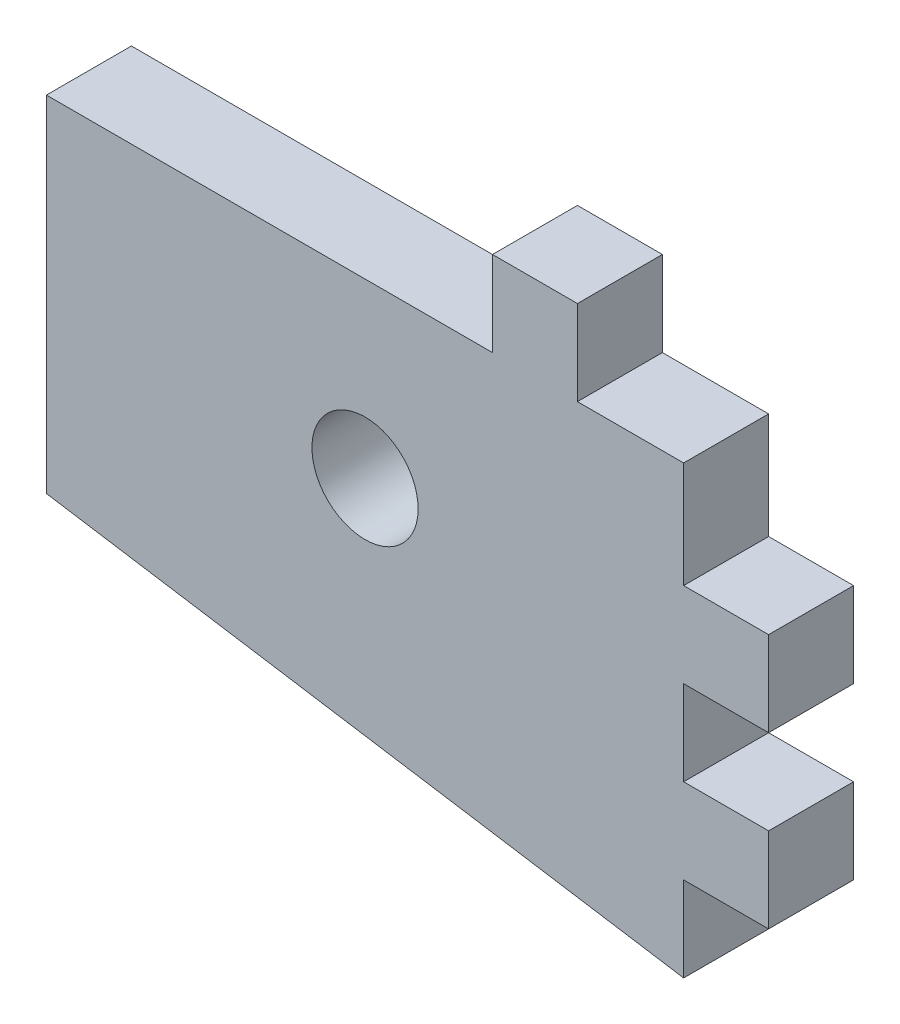
ISO-10303-21;
HEADER;
FILE_DESCRIPTION(('STEP AP214'),'2;1');
FILE_NAME('part.step','',(''),(''),'','','');
FILE_SCHEMA(('AUTOMOTIVE_DESIGN { 1 0 10303 214 1 1 1 1 }'));
ENDSEC;
DATA;
#1=APPLICATION_CONTEXT('core data for automotive mechanical design processes');
#2=APPLICATION_PROTOCOL_DEFINITION('international standard','automotive_design',2000,#1);
#3=PRODUCT_CONTEXT('',#1,'mechanical');
#4=PRODUCT('Part','Part','',(#3));
#5=PRODUCT_RELATED_PRODUCT_CATEGORY('part','',(#4));
#6=PRODUCT_DEFINITION_FORMATION('','',#4);
#7=PRODUCT_DEFINITION_CONTEXT('part definition',#1,'design');
#8=PRODUCT_DEFINITION('design','',#6,#7);
#9=PRODUCT_DEFINITION_SHAPE('','',#8);
#10=(LENGTH_UNIT() NAMED_UNIT(*) SI_UNIT(.MILLI.,.METRE.));
#11=(NAMED_UNIT(*) PLANE_ANGLE_UNIT() SI_UNIT($,.RADIAN.));
#12=(NAMED_UNIT(*) SI_UNIT($,.STERADIAN.) SOLID_ANGLE_UNIT());
#13=UNCERTAINTY_MEASURE_WITH_UNIT(LENGTH_MEASURE(1.E-05),#10,'distance_accuracy_value','');
#14=(GEOMETRIC_REPRESENTATION_CONTEXT(3) GLOBAL_UNCERTAINTY_ASSIGNED_CONTEXT((#13)) GLOBAL_UNIT_ASSIGNED_CONTEXT((#10,
#11,#12)) REPRESENTATION_CONTEXT('',''));
#15=CARTESIAN_POINT('',(0.,0.,0.));
#16=DIRECTION('',(0.,0.,1.));
#17=DIRECTION('',(1.,0.,0.));
#18=AXIS2_PLACEMENT_3D('',#15,#16,#17);
#19=CARTESIAN_POINT('',(0.,9.53947368421077,4.));
#20=DIRECTION('',(-1.,0.,0.));
#21=DIRECTION('',(0.,-1.,0.));
#22=AXIS2_PLACEMENT_3D('',#19,#20,#21);
#23=PLANE('',#22);
#24=DIRECTION('',(0.,1.,0.));
#25=VECTOR('',#24,1.);
#26=CARTESIAN_POINT('',(0.,9.53947368421077,4.));
#27=LINE('',#26,#25);
#28=CARTESIAN_POINT('',(0.,-3.46052631578922,4.));
#29=VERTEX_POINT('',#28);
#30=CARTESIAN_POINT('',(0.,0.539473684210779,4.));
#31=VERTEX_POINT('',#30);
#32=EDGE_CURVE('E39',#29,#31,#27,.T.);
#33=ORIENTED_EDGE('',*,*,#32,.F.);
#34=DIRECTION('',(0.,0.,1.));
#35=VECTOR('',#34,1.);
#36=CARTESIAN_POINT('',(0.,-3.46052631578923,0.));
#37=LINE('',#36,#35);
#38=CARTESIAN_POINT('',(0.,-3.46052631578923,0.));
#39=VERTEX_POINT('',#38);
#40=EDGE_CURVE('E295',#39,#29,#37,.T.);
#41=ORIENTED_EDGE('',*,*,#40,.F.);
#42=DIRECTION('',(0.,1.,0.));
#43=VECTOR('',#42,1.);
#44=CARTESIAN_POINT('',(0.,9.53947368421077,0.));
#45=LINE('',#44,#43);
#46=CARTESIAN_POINT('',(0.,0.539473684210772,0.));
#47=VERTEX_POINT('',#46);
#48=EDGE_CURVE('E182',#39,#47,#45,.T.);
#49=ORIENTED_EDGE('',*,*,#48,.T.);
#50=DIRECTION('',(0.,0.,1.));
#51=VECTOR('',#50,1.);
#52=CARTESIAN_POINT('',(0.,0.539473684210772,0.));
#53=LINE('',#52,#51);
#54=EDGE_CURVE('E250',#47,#31,#53,.T.);
#55=ORIENTED_EDGE('',*,*,#54,.T.);
#56=EDGE_LOOP('',(#33,#41,#49,#55));
#57=FACE_BOUND('',#56,.T.);
#58=ADVANCED_FACE('F35',(#57),#23,.F.);
#59=CARTESIAN_POINT('',(-30.,9.53947368421077,4.));
#60=DIRECTION('',(0.,-1.,0.));
#61=DIRECTION('',(1.,0.,0.));
#62=AXIS2_PLACEMENT_3D('',#59,#60,#61);
#63=PLANE('',#62);
#64=DIRECTION('',(0.,0.,1.));
#65=VECTOR('',#64,1.);
#66=CARTESIAN_POINT('',(-9.,9.53947368421077,0.));
#67=LINE('',#66,#65);
#68=CARTESIAN_POINT('',(-9.,9.53947368421077,0.));
#69=VERTEX_POINT('',#68);
#70=CARTESIAN_POINT('',(-9.,9.53947368421077,4.));
#71=VERTEX_POINT('',#70);
#72=EDGE_CURVE('E214',#69,#71,#67,.T.);
#73=ORIENTED_EDGE('',*,*,#72,.F.);
#74=DIRECTION('',(-1.,0.,0.));
#75=VECTOR('',#74,1.);
#76=CARTESIAN_POINT('',(-30.,9.53947368421077,0.));
#77=LINE('',#76,#75);
#78=CARTESIAN_POINT('',(-30.,9.53947368421077,0.));
#79=VERTEX_POINT('',#78);
#80=EDGE_CURVE('E262',#69,#79,#77,.T.);
#81=ORIENTED_EDGE('',*,*,#80,.T.);
#82=DIRECTION('',(0.,0.,-1.));
#83=VECTOR('',#82,1.);
#84=CARTESIAN_POINT('',(-30.,9.53947368421077,4.));
#85=LINE('',#84,#83);
#86=CARTESIAN_POINT('',(-30.,9.53947368421077,4.));
#87=VERTEX_POINT('',#86);
#88=EDGE_CURVE('E11',#87,#79,#85,.T.);
#89=ORIENTED_EDGE('',*,*,#88,.F.);
#90=DIRECTION('',(-1.,0.,0.));
#91=VECTOR('',#90,1.);
#92=CARTESIAN_POINT('',(-30.,9.53947368421077,4.));
#93=LINE('',#92,#91);
#94=EDGE_CURVE('E181',#71,#87,#93,.T.);
#95=ORIENTED_EDGE('',*,*,#94,.F.);
#96=EDGE_LOOP('',(#73,#81,#89,#95));
#97=FACE_BOUND('',#96,.T.);
#98=ADVANCED_FACE('F339',(#97),#63,.F.);
#99=DIRECTION('',(0.,0.,1.));
#100=VECTOR('',#99,1.);
#101=CARTESIAN_POINT('',(0.,4.53947368421077,0.));
#102=LINE('',#101,#100);
#103=CARTESIAN_POINT('',(0.,4.53947368421077,0.));
#104=VERTEX_POINT('',#103);
#105=CARTESIAN_POINT('',(0.,4.53947368421077,4.));
#106=VERTEX_POINT('',#105);
#107=EDGE_CURVE('E243',#104,#106,#102,.T.);
#108=ORIENTED_EDGE('',*,*,#107,.F.);
#109=CARTESIAN_POINT('',(0.,9.53947368421077,0.));
#110=VERTEX_POINT('',#109);
#111=EDGE_CURVE('E186',#104,#110,#45,.T.);
#112=ORIENTED_EDGE('',*,*,#111,.T.);
#113=DIRECTION('',(0.,0.,-1.));
#114=VECTOR('',#113,1.);
#115=CARTESIAN_POINT('',(0.,9.53947368421077,4.));
#116=LINE('',#115,#114);
#117=CARTESIAN_POINT('',(0.,9.53947368421077,4.));
#118=VERTEX_POINT('',#117);
#119=EDGE_CURVE('E196',#118,#110,#116,.T.);
#120=ORIENTED_EDGE('',*,*,#119,.F.);
#121=EDGE_CURVE('E304',#106,#118,#27,.T.);
#122=ORIENTED_EDGE('',*,*,#121,.F.);
#123=EDGE_LOOP('',(#108,#112,#120,#122));
#124=FACE_BOUND('',#123,.T.);
#125=ADVANCED_FACE('F278',(#124),#23,.F.);
#126=CARTESIAN_POINT('',(0.,0.,4.));
#127=DIRECTION('',(0.,0.,-1.));
#128=DIRECTION('',(-1.,0.,0.));
#129=AXIS2_PLACEMENT_3D('',#126,#127,#128);
#130=PLANE('',#129);
#131=CARTESIAN_POINT('',(-5.,9.53947368421077,4.));
#132=VERTEX_POINT('',#131);
#133=EDGE_CURVE('E184',#118,#132,#93,.T.);
#134=ORIENTED_EDGE('',*,*,#133,.T.);
#135=DIRECTION('',(0.,1.,0.));
#136=VECTOR('',#135,1.);
#137=CARTESIAN_POINT('',(-5.,9.53947368421077,4.));
#138=LINE('',#137,#136);
#139=CARTESIAN_POINT('',(-5.,13.5394736842108,4.));
#140=VERTEX_POINT('',#139);
#141=EDGE_CURVE('E61',#132,#140,#138,.T.);
#142=ORIENTED_EDGE('',*,*,#141,.T.);
#143=DIRECTION('',(-1.,0.,0.));
#144=VECTOR('',#143,1.);
#145=CARTESIAN_POINT('',(-5.,13.5394736842108,4.));
#146=LINE('',#145,#144);
#147=CARTESIAN_POINT('',(-9.,13.5394736842108,4.));
#148=VERTEX_POINT('',#147);
#149=EDGE_CURVE('E207',#140,#148,#146,.T.);
#150=ORIENTED_EDGE('',*,*,#149,.T.);
#151=DIRECTION('',(0.,-1.,0.));
#152=VECTOR('',#151,1.);
#153=CARTESIAN_POINT('',(-9.,9.53947368421077,4.));
#154=LINE('',#153,#152);
#155=EDGE_CURVE('E203',#148,#71,#154,.T.);
#156=ORIENTED_EDGE('',*,*,#155,.T.);
#157=ORIENTED_EDGE('',*,*,#94,.T.);
#158=DIRECTION('',(0.,-1.,0.));
#159=VECTOR('',#158,1.);
#160=CARTESIAN_POINT('',(-30.,9.53947368421077,4.));
#161=LINE('',#160,#159);
#162=CARTESIAN_POINT('',(-30.,-6.70899310605323,4.));
#163=VERTEX_POINT('',#162);
#164=EDGE_CURVE('E301',#87,#163,#161,.T.);
#165=ORIENTED_EDGE('',*,*,#164,.T.);
#166=DIRECTION('',(0.987688340595138,-0.156434465040228,0.));
#167=VECTOR('',#166,1.);
#168=CARTESIAN_POINT('',(-30.,-6.70899310605323,4.));
#169=LINE('',#168,#167);
#170=CARTESIAN_POINT('',(0.,-11.4605263157892,4.));
#171=VERTEX_POINT('',#170);
#172=EDGE_CURVE('E303',#163,#171,#169,.T.);
#173=ORIENTED_EDGE('',*,*,#172,.T.);
#174=CARTESIAN_POINT('',(0.,-7.46052631578923,4.));
#175=VERTEX_POINT('',#174);
#176=EDGE_CURVE('E284',#171,#175,#27,.T.);
#177=ORIENTED_EDGE('',*,*,#176,.T.);
#178=DIRECTION('',(1.,0.,0.));
#179=VECTOR('',#178,1.);
#180=CARTESIAN_POINT('',(0.,-7.46052631578923,4.));
#181=LINE('',#180,#179);
#182=CARTESIAN_POINT('',(4.,-7.46052631578923,4.));
#183=VERTEX_POINT('',#182);
#184=EDGE_CURVE('E157',#175,#183,#181,.T.);
#185=ORIENTED_EDGE('',*,*,#184,.T.);
#186=DIRECTION('',(0.,1.,0.));
#187=VECTOR('',#186,1.);
#188=CARTESIAN_POINT('',(4.,-3.46052631578923,4.));
#189=LINE('',#188,#187);
#190=CARTESIAN_POINT('',(4.,-3.46052631578923,4.));
#191=VERTEX_POINT('',#190);
#192=EDGE_CURVE('E368',#183,#191,#189,.T.);
#193=ORIENTED_EDGE('',*,*,#192,.T.);
#194=DIRECTION('',(-1.,0.,0.));
#195=VECTOR('',#194,1.);
#196=CARTESIAN_POINT('',(0.,-3.46052631578923,4.));
#197=LINE('',#196,#195);
#198=EDGE_CURVE('E53',#191,#29,#197,.T.);
#199=ORIENTED_EDGE('',*,*,#198,.T.);
#200=ORIENTED_EDGE('',*,*,#32,.T.);
#201=DIRECTION('',(1.,0.,0.));
#202=VECTOR('',#201,1.);
#203=CARTESIAN_POINT('',(0.,0.539473684210772,4.));
#204=LINE('',#203,#202);
#205=CARTESIAN_POINT('',(4.,0.539473684210771,4.));
#206=VERTEX_POINT('',#205);
#207=EDGE_CURVE('E237',#31,#206,#204,.T.);
#208=ORIENTED_EDGE('',*,*,#207,.T.);
#209=DIRECTION('',(0.,1.,0.));
#210=VECTOR('',#209,1.);
#211=CARTESIAN_POINT('',(4.,0.539473684210771,4.));
#212=LINE('',#211,#210);
#213=CARTESIAN_POINT('',(4.,4.53947368421077,4.));
#214=VERTEX_POINT('',#213);
#215=EDGE_CURVE('E233',#206,#214,#212,.T.);
#216=ORIENTED_EDGE('',*,*,#215,.T.);
#217=DIRECTION('',(-1.,0.,0.));
#218=VECTOR('',#217,1.);
#219=CARTESIAN_POINT('',(0.,4.53947368421077,4.));
#220=LINE('',#219,#218);
#221=EDGE_CURVE('E236',#214,#106,#220,.T.);
#222=ORIENTED_EDGE('',*,*,#221,.T.);
#223=ORIENTED_EDGE('',*,*,#121,.T.);
#224=EDGE_LOOP('',(#134,#142,#150,#156,#157,#165,#173,#177,#185,#193,#199,#200,#208,#216,#222,#223));
#225=FACE_BOUND('',#224,.T.);
#226=CARTESIAN_POINT('',(-15.,1.41524028907877,4.));
#227=DIRECTION('',(0.,0.,1.));
#228=DIRECTION('',(1.,0.,0.));
#229=AXIS2_PLACEMENT_3D('',#226,#227,#228);
#230=CIRCLE('',#229,2.5);
#231=CARTESIAN_POINT('',(-12.5,1.41524028907877,4.));
#232=VERTEX_POINT('',#231);
#233=EDGE_CURVE('E316',#232,#232,#230,.T.);
#234=ORIENTED_EDGE('',*,*,#233,.F.);
#235=EDGE_LOOP('',(#234));
#236=FACE_BOUND('',#235,.T.);
#237=ADVANCED_FACE('F349',(#225,#236),#130,.F.);
#238=CARTESIAN_POINT('',(0.,0.,0.));
#239=DIRECTION('',(0.,0.,-1.));
#240=DIRECTION('',(-1.,0.,0.));
#241=AXIS2_PLACEMENT_3D('',#238,#239,#240);
#242=PLANE('',#241);
#243=CARTESIAN_POINT('',(-5.,9.53947368421077,0.));
#244=VERTEX_POINT('',#243);
#245=EDGE_CURVE('E257',#110,#244,#77,.T.);
#246=ORIENTED_EDGE('',*,*,#245,.F.);
#247=ORIENTED_EDGE('',*,*,#111,.F.);
#248=DIRECTION('',(-1.,0.,0.));
#249=VECTOR('',#248,1.);
#250=CARTESIAN_POINT('',(0.,4.53947368421077,0.));
#251=LINE('',#250,#249);
#252=CARTESIAN_POINT('',(4.,4.53947368421077,0.));
#253=VERTEX_POINT('',#252);
#254=EDGE_CURVE('E231',#253,#104,#251,.T.);
#255=ORIENTED_EDGE('',*,*,#254,.F.);
#256=DIRECTION('',(0.,1.,0.));
#257=VECTOR('',#256,1.);
#258=CARTESIAN_POINT('',(4.,0.539473684210771,0.));
#259=LINE('',#258,#257);
#260=CARTESIAN_POINT('',(4.,0.539473684210771,0.));
#261=VERTEX_POINT('',#260);
#262=EDGE_CURVE('E228',#261,#253,#259,.T.);
#263=ORIENTED_EDGE('',*,*,#262,.F.);
#264=DIRECTION('',(1.,0.,0.));
#265=VECTOR('',#264,1.);
#266=CARTESIAN_POINT('',(0.,0.539473684210772,0.));
#267=LINE('',#266,#265);
#268=EDGE_CURVE('E232',#47,#261,#267,.T.);
#269=ORIENTED_EDGE('',*,*,#268,.F.);
#270=ORIENTED_EDGE('',*,*,#48,.F.);
#271=DIRECTION('',(-1.,0.,0.));
#272=VECTOR('',#271,1.);
#273=CARTESIAN_POINT('',(0.,-3.46052631578923,0.));
#274=LINE('',#273,#272);
#275=CARTESIAN_POINT('',(4.,-3.46052631578923,0.));
#276=VERTEX_POINT('',#275);
#277=EDGE_CURVE('E163',#276,#39,#274,.T.);
#278=ORIENTED_EDGE('',*,*,#277,.F.);
#279=DIRECTION('',(0.,1.,0.));
#280=VECTOR('',#279,1.);
#281=CARTESIAN_POINT('',(4.,-3.46052631578923,0.));
#282=LINE('',#281,#280);
#283=CARTESIAN_POINT('',(4.,-7.46052631578923,0.));
#284=VERTEX_POINT('',#283);
#285=EDGE_CURVE('E175',#284,#276,#282,.T.);
#286=ORIENTED_EDGE('',*,*,#285,.F.);
#287=DIRECTION('',(1.,0.,0.));
#288=VECTOR('',#287,1.);
#289=CARTESIAN_POINT('',(0.,-7.46052631578923,0.));
#290=LINE('',#289,#288);
#291=CARTESIAN_POINT('',(0.,-7.46052631578923,0.));
#292=VERTEX_POINT('',#291);
#293=EDGE_CURVE('E155',#292,#284,#290,.T.);
#294=ORIENTED_EDGE('',*,*,#293,.F.);
#295=CARTESIAN_POINT('',(0.,-11.4605263157892,0.));
#296=VERTEX_POINT('',#295);
#297=EDGE_CURVE('E172',#296,#292,#45,.T.);
#298=ORIENTED_EDGE('',*,*,#297,.F.);
#299=DIRECTION('',(0.987688340595138,-0.156434465040228,0.));
#300=VECTOR('',#299,1.);
#301=CARTESIAN_POINT('',(-30.,-6.70899310605323,0.));
#302=LINE('',#301,#300);
#303=CARTESIAN_POINT('',(-30.,-6.70899310605323,0.));
#304=VERTEX_POINT('',#303);
#305=EDGE_CURVE('E194',#304,#296,#302,.T.);
#306=ORIENTED_EDGE('',*,*,#305,.F.);
#307=DIRECTION('',(0.,-1.,0.));
#308=VECTOR('',#307,1.);
#309=CARTESIAN_POINT('',(-30.,9.53947368421077,0.));
#310=LINE('',#309,#308);
#311=EDGE_CURVE('E261',#79,#304,#310,.T.);
#312=ORIENTED_EDGE('',*,*,#311,.F.);
#313=ORIENTED_EDGE('',*,*,#80,.F.);
#314=DIRECTION('',(0.,-1.,0.));
#315=VECTOR('',#314,1.);
#316=CARTESIAN_POINT('',(-9.,9.53947368421077,0.));
#317=LINE('',#316,#315);
#318=CARTESIAN_POINT('',(-9.,13.5394736842108,0.));
#319=VERTEX_POINT('',#318);
#320=EDGE_CURVE('E210',#319,#69,#317,.T.);
#321=ORIENTED_EDGE('',*,*,#320,.F.);
#322=DIRECTION('',(-1.,0.,0.));
#323=VECTOR('',#322,1.);
#324=CARTESIAN_POINT('',(-5.,13.5394736842108,0.));
#325=LINE('',#324,#323);
#326=CARTESIAN_POINT('',(-5.,13.5394736842108,0.));
#327=VERTEX_POINT('',#326);
#328=EDGE_CURVE('E213',#327,#319,#325,.T.);
#329=ORIENTED_EDGE('',*,*,#328,.F.);
#330=DIRECTION('',(0.,1.,0.));
#331=VECTOR('',#330,1.);
#332=CARTESIAN_POINT('',(-5.,9.53947368421077,0.));
#333=LINE('',#332,#331);
#334=EDGE_CURVE('E206',#244,#327,#333,.T.);
#335=ORIENTED_EDGE('',*,*,#334,.F.);
#336=EDGE_LOOP('',(#246,#247,#255,#263,#269,#270,#278,#286,#294,#298,#306,#312,#313,#321,#329,#335));
#337=FACE_BOUND('',#336,.T.);
#338=CARTESIAN_POINT('',(-15.,1.41524028907877,0.));
#339=DIRECTION('',(0.,0.,1.));
#340=DIRECTION('',(1.,0.,0.));
#341=AXIS2_PLACEMENT_3D('',#338,#339,#340);
#342=CIRCLE('',#341,2.5);
#343=CARTESIAN_POINT('',(-12.5,1.41524028907877,0.));
#344=VERTEX_POINT('',#343);
#345=EDGE_CURVE('E246',#344,#344,#342,.T.);
#346=ORIENTED_EDGE('',*,*,#345,.T.);
#347=EDGE_LOOP('',(#346));
#348=FACE_BOUND('',#347,.T.);
#349=ADVANCED_FACE('F169',(#337,#348),#242,.T.);
#350=ORIENTED_EDGE('',*,*,#245,.T.);
#351=DIRECTION('',(0.,0.,1.));
#352=VECTOR('',#351,1.);
#353=CARTESIAN_POINT('',(-5.,9.53947368421077,0.));
#354=LINE('',#353,#352);
#355=EDGE_CURVE('E217',#244,#132,#354,.T.);
#356=ORIENTED_EDGE('',*,*,#355,.T.);
#357=ORIENTED_EDGE('',*,*,#133,.F.);
#358=ORIENTED_EDGE('',*,*,#119,.T.);
#359=EDGE_LOOP('',(#350,#356,#357,#358));
#360=FACE_BOUND('',#359,.T.);
#361=ADVANCED_FACE('F37',(#360),#63,.F.);
#362=CARTESIAN_POINT('',(-30.,9.53947368421077,4.));
#363=DIRECTION('',(1.,0.,0.));
#364=DIRECTION('',(0.,1.,0.));
#365=AXIS2_PLACEMENT_3D('',#362,#363,#364);
#366=PLANE('',#365);
#367=ORIENTED_EDGE('',*,*,#311,.T.);
#368=DIRECTION('',(0.,0.,-1.));
#369=VECTOR('',#368,1.);
#370=CARTESIAN_POINT('',(-30.,-6.70899310605323,4.));
#371=LINE('',#370,#369);
#372=EDGE_CURVE('E45',#163,#304,#371,.T.);
#373=ORIENTED_EDGE('',*,*,#372,.F.);
#374=ORIENTED_EDGE('',*,*,#164,.F.);
#375=ORIENTED_EDGE('',*,*,#88,.T.);
#376=EDGE_LOOP('',(#367,#373,#374,#375));
#377=FACE_BOUND('',#376,.T.);
#378=ADVANCED_FACE('F476',(#377),#366,.F.);
#379=CARTESIAN_POINT('',(-30.,-6.70899310605323,4.));
#380=DIRECTION('',(0.156434465040228,0.987688340595138,0.));
#381=DIRECTION('',(-0.987688340595138,0.156434465040228,0.));
#382=AXIS2_PLACEMENT_3D('',#379,#380,#381);
#383=PLANE('',#382);
#384=ORIENTED_EDGE('',*,*,#305,.T.);
#385=DIRECTION('',(0.,0.,-1.));
#386=VECTOR('',#385,1.);
#387=CARTESIAN_POINT('',(0.,-11.4605263157892,4.));
#388=LINE('',#387,#386);
#389=EDGE_CURVE('E180',#171,#296,#388,.T.);
#390=ORIENTED_EDGE('',*,*,#389,.F.);
#391=ORIENTED_EDGE('',*,*,#172,.F.);
#392=ORIENTED_EDGE('',*,*,#372,.T.);
#393=EDGE_LOOP('',(#384,#390,#391,#392));
#394=FACE_BOUND('',#393,.T.);
#395=ADVANCED_FACE('F334',(#394),#383,.F.);
#396=ORIENTED_EDGE('',*,*,#297,.T.);
#397=DIRECTION('',(0.,0.,1.));
#398=VECTOR('',#397,1.);
#399=CARTESIAN_POINT('',(0.,-7.46052631578923,0.));
#400=LINE('',#399,#398);
#401=EDGE_CURVE('E152',#292,#175,#400,.T.);
#402=ORIENTED_EDGE('',*,*,#401,.T.);
#403=ORIENTED_EDGE('',*,*,#176,.F.);
#404=ORIENTED_EDGE('',*,*,#389,.T.);
#405=EDGE_LOOP('',(#396,#402,#403,#404));
#406=FACE_BOUND('',#405,.T.);
#407=ADVANCED_FACE('F178',(#406),#23,.F.);
#408=CARTESIAN_POINT('',(-15.,1.41524028907877,4.));
#409=DIRECTION('',(0.,0.,-1.));
#410=DIRECTION('',(-1.,0.,0.));
#411=AXIS2_PLACEMENT_3D('',#408,#409,#410);
#412=CYLINDRICAL_SURFACE('',#411,2.5);
#413=ORIENTED_EDGE('',*,*,#233,.T.);
#414=EDGE_LOOP('',(#413));
#415=FACE_BOUND('',#414,.T.);
#416=ORIENTED_EDGE('',*,*,#345,.F.);
#417=EDGE_LOOP('',(#416));
#418=FACE_BOUND('',#417,.T.);
#419=ADVANCED_FACE('F323',(#415,#418),#412,.F.);
#420=CARTESIAN_POINT('',(0.,4.53947368421077,0.));
#421=DIRECTION('',(0.,1.,0.));
#422=DIRECTION('',(0.,0.,1.));
#423=AXIS2_PLACEMENT_3D('',#420,#421,#422);
#424=PLANE('',#423);
#425=ORIENTED_EDGE('',*,*,#221,.F.);
#426=DIRECTION('',(0.,0.,1.));
#427=VECTOR('',#426,1.);
#428=CARTESIAN_POINT('',(4.,4.53947368421077,0.));
#429=LINE('',#428,#427);
#430=EDGE_CURVE('E240',#253,#214,#429,.T.);
#431=ORIENTED_EDGE('',*,*,#430,.F.);
#432=ORIENTED_EDGE('',*,*,#254,.T.);
#433=ORIENTED_EDGE('',*,*,#107,.T.);
#434=EDGE_LOOP('',(#425,#431,#432,#433));
#435=FACE_BOUND('',#434,.T.);
#436=ADVANCED_FACE('F325',(#435),#424,.T.);
#437=CARTESIAN_POINT('',(4.,0.539473684210771,0.));
#438=DIRECTION('',(1.,0.,0.));
#439=DIRECTION('',(0.,0.,-1.));
#440=AXIS2_PLACEMENT_3D('',#437,#438,#439);
#441=PLANE('',#440);
#442=ORIENTED_EDGE('',*,*,#215,.F.);
#443=DIRECTION('',(0.,0.,1.));
#444=VECTOR('',#443,1.);
#445=CARTESIAN_POINT('',(4.,0.539473684210771,0.));
#446=LINE('',#445,#444);
#447=EDGE_CURVE('E314',#261,#206,#446,.T.);
#448=ORIENTED_EDGE('',*,*,#447,.F.);
#449=ORIENTED_EDGE('',*,*,#262,.T.);
#450=ORIENTED_EDGE('',*,*,#430,.T.);
#451=EDGE_LOOP('',(#442,#448,#449,#450));
#452=FACE_BOUND('',#451,.T.);
#453=ADVANCED_FACE('F331',(#452),#441,.T.);
#454=CARTESIAN_POINT('',(0.,0.539473684210772,0.));
#455=DIRECTION('',(0.,-1.,0.));
#456=DIRECTION('',(1.,0.,0.));
#457=AXIS2_PLACEMENT_3D('',#454,#455,#456);
#458=PLANE('',#457);
#459=ORIENTED_EDGE('',*,*,#207,.F.);
#460=ORIENTED_EDGE('',*,*,#54,.F.);
#461=ORIENTED_EDGE('',*,*,#268,.T.);
#462=ORIENTED_EDGE('',*,*,#447,.T.);
#463=EDGE_LOOP('',(#459,#460,#461,#462));
#464=FACE_BOUND('',#463,.T.);
#465=ADVANCED_FACE('F383',(#464),#458,.T.);
#466=CARTESIAN_POINT('',(-5.,9.53947368421077,0.));
#467=DIRECTION('',(1.,0.,0.));
#468=DIRECTION('',(0.,0.,-1.));
#469=AXIS2_PLACEMENT_3D('',#466,#467,#468);
#470=PLANE('',#469);
#471=ORIENTED_EDGE('',*,*,#141,.F.);
#472=ORIENTED_EDGE('',*,*,#355,.F.);
#473=ORIENTED_EDGE('',*,*,#334,.T.);
#474=DIRECTION('',(0.,0.,1.));
#475=VECTOR('',#474,1.);
#476=CARTESIAN_POINT('',(-5.,13.5394736842108,0.));
#477=LINE('',#476,#475);
#478=EDGE_CURVE('E212',#327,#140,#477,.T.);
#479=ORIENTED_EDGE('',*,*,#478,.T.);
#480=EDGE_LOOP('',(#471,#472,#473,#479));
#481=FACE_BOUND('',#480,.T.);
#482=ADVANCED_FACE('F394',(#481),#470,.T.);
#483=CARTESIAN_POINT('',(-9.,9.53947368421077,0.));
#484=DIRECTION('',(-1.,0.,0.));
#485=DIRECTION('',(0.,0.,1.));
#486=AXIS2_PLACEMENT_3D('',#483,#484,#485);
#487=PLANE('',#486);
#488=ORIENTED_EDGE('',*,*,#155,.F.);
#489=DIRECTION('',(0.,0.,1.));
#490=VECTOR('',#489,1.);
#491=CARTESIAN_POINT('',(-9.,13.5394736842108,0.));
#492=LINE('',#491,#490);
#493=EDGE_CURVE('E218',#319,#148,#492,.T.);
#494=ORIENTED_EDGE('',*,*,#493,.F.);
#495=ORIENTED_EDGE('',*,*,#320,.T.);
#496=ORIENTED_EDGE('',*,*,#72,.T.);
#497=EDGE_LOOP('',(#488,#494,#495,#496));
#498=FACE_BOUND('',#497,.T.);
#499=ADVANCED_FACE('F398',(#498),#487,.T.);
#500=CARTESIAN_POINT('',(-5.,13.5394736842108,0.));
#501=DIRECTION('',(0.,1.,0.));
#502=DIRECTION('',(0.,0.,1.));
#503=AXIS2_PLACEMENT_3D('',#500,#501,#502);
#504=PLANE('',#503);
#505=ORIENTED_EDGE('',*,*,#149,.F.);
#506=ORIENTED_EDGE('',*,*,#478,.F.);
#507=ORIENTED_EDGE('',*,*,#328,.T.);
#508=ORIENTED_EDGE('',*,*,#493,.T.);
#509=EDGE_LOOP('',(#505,#506,#507,#508));
#510=FACE_BOUND('',#509,.T.);
#511=ADVANCED_FACE('F399',(#510),#504,.T.);
#512=CARTESIAN_POINT('',(0.,-3.46052631578923,0.));
#513=DIRECTION('',(0.,1.,0.));
#514=DIRECTION('',(0.,0.,1.));
#515=AXIS2_PLACEMENT_3D('',#512,#513,#514);
#516=PLANE('',#515);
#517=ORIENTED_EDGE('',*,*,#198,.F.);
#518=DIRECTION('',(0.,0.,1.));
#519=VECTOR('',#518,1.);
#520=CARTESIAN_POINT('',(4.,-3.46052631578923,0.));
#521=LINE('',#520,#519);
#522=EDGE_CURVE('E364',#276,#191,#521,.T.);
#523=ORIENTED_EDGE('',*,*,#522,.F.);
#524=ORIENTED_EDGE('',*,*,#277,.T.);
#525=ORIENTED_EDGE('',*,*,#40,.T.);
#526=EDGE_LOOP('',(#517,#523,#524,#525));
#527=FACE_BOUND('',#526,.T.);
#528=ADVANCED_FACE('F379',(#527),#516,.T.);
#529=CARTESIAN_POINT('',(4.,-3.46052631578923,0.));
#530=DIRECTION('',(1.,0.,0.));
#531=DIRECTION('',(0.,1.,0.));
#532=AXIS2_PLACEMENT_3D('',#529,#530,#531);
#533=PLANE('',#532);
#534=ORIENTED_EDGE('',*,*,#192,.F.);
#535=DIRECTION('',(0.,0.,1.));
#536=VECTOR('',#535,1.);
#537=CARTESIAN_POINT('',(4.,-7.46052631578923,0.));
#538=LINE('',#537,#536);
#539=EDGE_CURVE('E162',#284,#183,#538,.T.);
#540=ORIENTED_EDGE('',*,*,#539,.F.);
#541=ORIENTED_EDGE('',*,*,#285,.T.);
#542=ORIENTED_EDGE('',*,*,#522,.T.);
#543=EDGE_LOOP('',(#534,#540,#541,#542));
#544=FACE_BOUND('',#543,.T.);
#545=ADVANCED_FACE('F374',(#544),#533,.T.);
#546=CARTESIAN_POINT('',(0.,-7.46052631578923,0.));
#547=DIRECTION('',(0.,-1.,0.));
#548=DIRECTION('',(0.,0.,-1.));
#549=AXIS2_PLACEMENT_3D('',#546,#547,#548);
#550=PLANE('',#549);
#551=ORIENTED_EDGE('',*,*,#184,.F.);
#552=ORIENTED_EDGE('',*,*,#401,.F.);
#553=ORIENTED_EDGE('',*,*,#293,.T.);
#554=ORIENTED_EDGE('',*,*,#539,.T.);
#555=EDGE_LOOP('',(#551,#552,#553,#554));
#556=FACE_BOUND('',#555,.T.);
#557=ADVANCED_FACE('F154',(#556),#550,.T.);
#558=CLOSED_SHELL('',(#58,#98,#125,#237,#349,#361,#378,#395,#407,#419,#436,#453,#465,#482,#499,
#511,#528,#545,#557));
#559=MANIFOLD_SOLID_BREP('B2',#558);
#560=ADVANCED_BREP_SHAPE_REPRESENTATION('',(#18,#559),#14);
#561=SHAPE_DEFINITION_REPRESENTATION(#9,#560);
ENDSEC;
END-ISO-10303-21;
